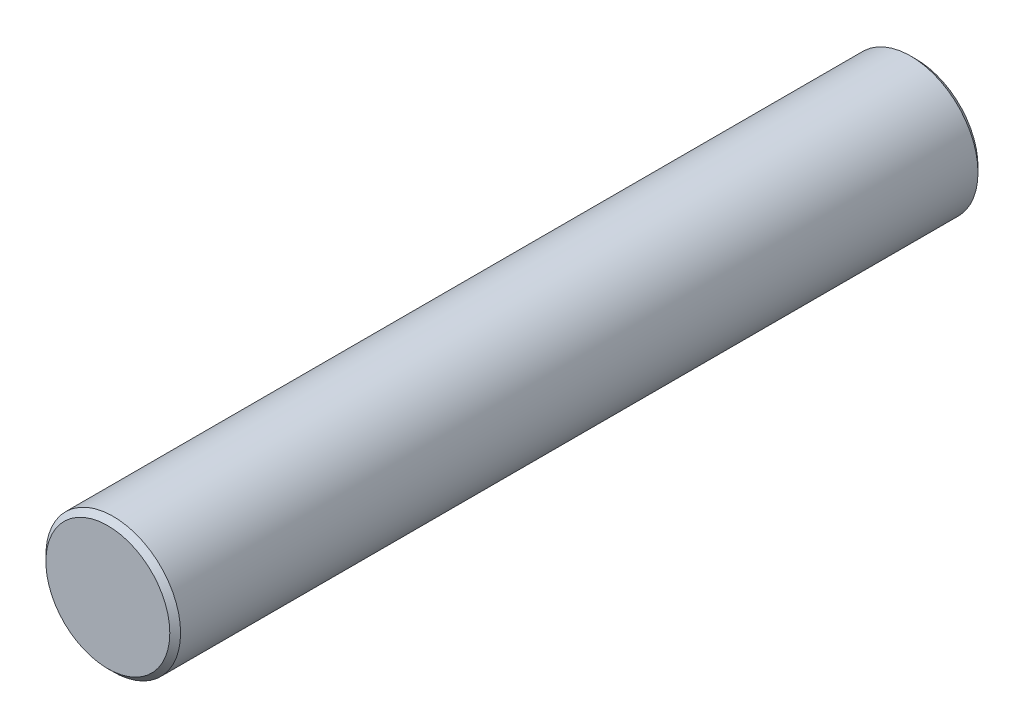
ISO-10303-21;
HEADER;
FILE_DESCRIPTION(('STEP AP214'),'2;1');
FILE_NAME('part.step','',(''),(''),'','','');
FILE_SCHEMA(('AUTOMOTIVE_DESIGN { 1 0 10303 214 1 1 1 1 }'));
ENDSEC;
DATA;
#1=APPLICATION_CONTEXT('core data for automotive mechanical design processes');
#2=APPLICATION_PROTOCOL_DEFINITION('international standard','automotive_design',2000,#1);
#3=PRODUCT_CONTEXT('',#1,'mechanical');
#4=PRODUCT('Part','Part','',(#3));
#5=PRODUCT_RELATED_PRODUCT_CATEGORY('part','',(#4));
#6=PRODUCT_DEFINITION_FORMATION('','',#4);
#7=PRODUCT_DEFINITION_CONTEXT('part definition',#1,'design');
#8=PRODUCT_DEFINITION('design','',#6,#7);
#9=PRODUCT_DEFINITION_SHAPE('','',#8);
#10=(LENGTH_UNIT() NAMED_UNIT(*) SI_UNIT(.MILLI.,.METRE.));
#11=(NAMED_UNIT(*) PLANE_ANGLE_UNIT() SI_UNIT($,.RADIAN.));
#12=(NAMED_UNIT(*) SI_UNIT($,.STERADIAN.) SOLID_ANGLE_UNIT());
#13=UNCERTAINTY_MEASURE_WITH_UNIT(LENGTH_MEASURE(1.E-05),#10,'distance_accuracy_value','');
#14=(GEOMETRIC_REPRESENTATION_CONTEXT(3) GLOBAL_UNCERTAINTY_ASSIGNED_CONTEXT((#13)) GLOBAL_UNIT_ASSIGNED_CONTEXT((#10,
#11,#12)) REPRESENTATION_CONTEXT('',''));
#15=CARTESIAN_POINT('',(0.,0.,0.));
#16=DIRECTION('',(0.,0.,1.));
#17=DIRECTION('',(1.,0.,0.));
#18=AXIS2_PLACEMENT_3D('',#15,#16,#17);
#19=CARTESIAN_POINT('',(0.,0.,30.));
#20=DIRECTION('',(0.,0.,-1.));
#21=DIRECTION('',(-1.,0.,0.));
#22=AXIS2_PLACEMENT_3D('',#19,#20,#21);
#23=CYLINDRICAL_SURFACE('',#22,2.5);
#24=CARTESIAN_POINT('',(0.,0.,29.8));
#25=DIRECTION('',(0.,0.,1.));
#26=DIRECTION('',(1.,0.,0.));
#27=AXIS2_PLACEMENT_3D('',#24,#25,#26);
#28=CIRCLE('',#27,2.5);
#29=CARTESIAN_POINT('',(2.5,0.,29.8));
#30=VERTEX_POINT('',#29);
#31=EDGE_CURVE('E45',#30,#30,#28,.F.);
#32=ORIENTED_EDGE('',*,*,#31,.T.);
#33=EDGE_LOOP('',(#32));
#34=FACE_BOUND('',#33,.T.);
#35=CARTESIAN_POINT('',(0.,0.,0.199999999999999));
#36=DIRECTION('',(0.,0.,1.));
#37=DIRECTION('',(1.,0.,0.));
#38=AXIS2_PLACEMENT_3D('',#35,#36,#37);
#39=CIRCLE('',#38,2.5);
#40=CARTESIAN_POINT('',(2.5,0.,0.199999999999999));
#41=VERTEX_POINT('',#40);
#42=EDGE_CURVE('E50',#41,#41,#39,.T.);
#43=ORIENTED_EDGE('',*,*,#42,.T.);
#44=EDGE_LOOP('',(#43));
#45=FACE_BOUND('',#44,.T.);
#46=ADVANCED_FACE('F37',(#34,#45),#23,.T.);
#47=CARTESIAN_POINT('',(0.,0.,30.));
#48=DIRECTION('',(0.,0.,1.));
#49=DIRECTION('',(1.,0.,0.));
#50=AXIS2_PLACEMENT_3D('',#47,#48,#49);
#51=PLANE('',#50);
#52=CARTESIAN_POINT('',(0.,0.,30.));
#53=DIRECTION('',(0.,0.,1.));
#54=DIRECTION('',(1.,0.,0.));
#55=AXIS2_PLACEMENT_3D('',#52,#53,#54);
#56=CIRCLE('',#55,2.3);
#57=CARTESIAN_POINT('',(2.3,0.,30.));
#58=VERTEX_POINT('',#57);
#59=EDGE_CURVE('E55',#58,#58,#56,.T.);
#60=ORIENTED_EDGE('',*,*,#59,.T.);
#61=EDGE_LOOP('',(#60));
#62=FACE_BOUND('',#61,.T.);
#63=ADVANCED_FACE('F62',(#62),#51,.T.);
#64=CARTESIAN_POINT('',(0.,0.,0.));
#65=DIRECTION('',(0.,0.,1.));
#66=DIRECTION('',(1.,0.,0.));
#67=AXIS2_PLACEMENT_3D('',#64,#65,#66);
#68=PLANE('',#67);
#69=CARTESIAN_POINT('',(0.,0.,0.));
#70=DIRECTION('',(0.,0.,1.));
#71=DIRECTION('',(1.,0.,0.));
#72=AXIS2_PLACEMENT_3D('',#69,#70,#71);
#73=CIRCLE('',#72,2.3);
#74=CARTESIAN_POINT('',(2.3,0.,0.));
#75=VERTEX_POINT('',#74);
#76=EDGE_CURVE('E10',#75,#75,#73,.F.);
#77=ORIENTED_EDGE('',*,*,#76,.T.);
#78=EDGE_LOOP('',(#77));
#79=FACE_BOUND('',#78,.T.);
#80=ADVANCED_FACE('F66',(#79),#68,.F.);
#81=CARTESIAN_POINT('',(0.,0.,30.));
#82=DIRECTION('',(0.,0.,-1.));
#83=DIRECTION('',(-1.,0.,0.));
#84=AXIS2_PLACEMENT_3D('',#81,#82,#83);
#85=CONICAL_SURFACE('',#84,2.3,0.78539816339745);
#86=ORIENTED_EDGE('',*,*,#31,.F.);
#87=EDGE_LOOP('',(#86));
#88=FACE_BOUND('',#87,.T.);
#89=ORIENTED_EDGE('',*,*,#59,.F.);
#90=EDGE_LOOP('',(#89));
#91=FACE_BOUND('',#90,.T.);
#92=ADVANCED_FACE('F64',(#88,#91),#85,.T.);
#93=CARTESIAN_POINT('',(0.,0.,0.199999999999999));
#94=DIRECTION('',(0.,0.,1.));
#95=DIRECTION('',(1.,0.,0.));
#96=AXIS2_PLACEMENT_3D('',#93,#94,#95);
#97=CONICAL_SURFACE('',#96,2.5,0.78539816339745);
#98=ORIENTED_EDGE('',*,*,#76,.F.);
#99=EDGE_LOOP('',(#98));
#100=FACE_BOUND('',#99,.T.);
#101=ORIENTED_EDGE('',*,*,#42,.F.);
#102=EDGE_LOOP('',(#101));
#103=FACE_BOUND('',#102,.T.);
#104=ADVANCED_FACE('F39',(#100,#103),#97,.T.);
#105=CLOSED_SHELL('',(#46,#63,#80,#92,#104));
#106=MANIFOLD_SOLID_BREP('B2',#105);
#107=ADVANCED_BREP_SHAPE_REPRESENTATION('',(#18,#106),#14);
#108=SHAPE_DEFINITION_REPRESENTATION(#9,#107);
ENDSEC;
END-ISO-10303-21;
